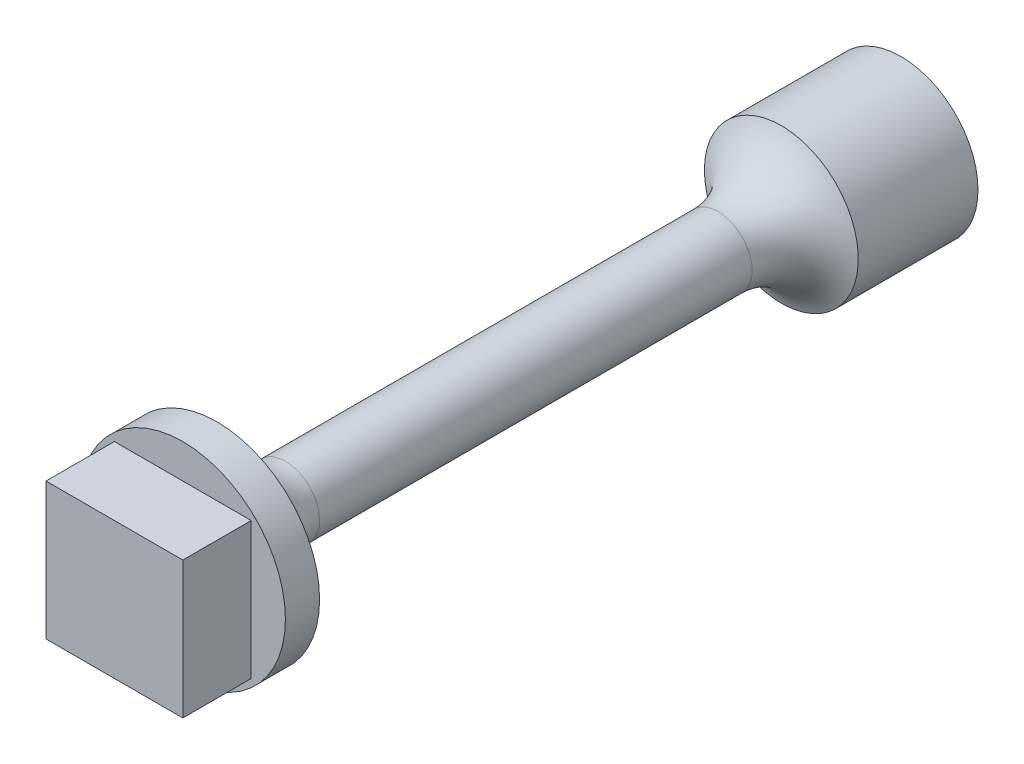
ISO-10303-21;
HEADER;
FILE_DESCRIPTION(('STEP AP214'),'2;1');
FILE_NAME('part.step','',(''),(''),'','','');
FILE_SCHEMA(('AUTOMOTIVE_DESIGN { 1 0 10303 214 1 1 1 1 }'));
ENDSEC;
DATA;
#1=APPLICATION_CONTEXT('core data for automotive mechanical design processes');
#2=APPLICATION_PROTOCOL_DEFINITION('international standard','automotive_design',2000,#1);
#3=PRODUCT_CONTEXT('',#1,'mechanical');
#4=PRODUCT('Part','Part','',(#3));
#5=PRODUCT_RELATED_PRODUCT_CATEGORY('part','',(#4));
#6=PRODUCT_DEFINITION_FORMATION('','',#4);
#7=PRODUCT_DEFINITION_CONTEXT('part definition',#1,'design');
#8=PRODUCT_DEFINITION('design','',#6,#7);
#9=PRODUCT_DEFINITION_SHAPE('','',#8);
#10=(LENGTH_UNIT() NAMED_UNIT(*) SI_UNIT(.MILLI.,.METRE.));
#11=(NAMED_UNIT(*) PLANE_ANGLE_UNIT() SI_UNIT($,.RADIAN.));
#12=(NAMED_UNIT(*) SI_UNIT($,.STERADIAN.) SOLID_ANGLE_UNIT());
#13=UNCERTAINTY_MEASURE_WITH_UNIT(LENGTH_MEASURE(1.E-05),#10,'distance_accuracy_value','');
#14=(GEOMETRIC_REPRESENTATION_CONTEXT(3) GLOBAL_UNCERTAINTY_ASSIGNED_CONTEXT((#13)) GLOBAL_UNIT_ASSIGNED_CONTEXT((#10,
#11,#12)) REPRESENTATION_CONTEXT('',''));
#15=CARTESIAN_POINT('',(0.,0.,0.));
#16=DIRECTION('',(0.,0.,1.));
#17=DIRECTION('',(1.,0.,0.));
#18=AXIS2_PLACEMENT_3D('',#15,#16,#17);
#19=CARTESIAN_POINT('',(0.,0.,21.));
#20=DIRECTION('',(0.,0.,-1.));
#21=DIRECTION('',(-1.,0.,0.));
#22=AXIS2_PLACEMENT_3D('',#19,#20,#21);
#23=CYLINDRICAL_SURFACE('',#22,3.);
#24=CARTESIAN_POINT('',(0.,0.,21.));
#25=DIRECTION('',(0.,0.,1.));
#26=DIRECTION('',(1.,0.,0.));
#27=AXIS2_PLACEMENT_3D('',#24,#25,#26);
#28=CIRCLE('',#27,3.);
#29=CARTESIAN_POINT('',(3.,0.,21.));
#30=VERTEX_POINT('',#29);
#31=EDGE_CURVE('E135',#30,#30,#28,.T.);
#32=ORIENTED_EDGE('',*,*,#31,.F.);
#33=EDGE_LOOP('',(#32));
#34=FACE_BOUND('',#33,.T.);
#35=CARTESIAN_POINT('',(0.,0.,20.));
#36=DIRECTION('',(0.,0.,1.));
#37=DIRECTION('',(1.,0.,0.));
#38=AXIS2_PLACEMENT_3D('',#35,#36,#37);
#39=CIRCLE('',#38,3.);
#40=CARTESIAN_POINT('',(3.,0.,20.));
#41=VERTEX_POINT('',#40);
#42=EDGE_CURVE('E130',#41,#41,#39,.T.);
#43=ORIENTED_EDGE('',*,*,#42,.T.);
#44=EDGE_LOOP('',(#43));
#45=FACE_BOUND('',#44,.T.);
#46=ADVANCED_FACE('F41',(#34,#45),#23,.T.);
#47=CARTESIAN_POINT('',(0.,0.,21.));
#48=DIRECTION('',(0.,0.,1.));
#49=DIRECTION('',(1.,0.,0.));
#50=AXIS2_PLACEMENT_3D('',#47,#48,#49);
#51=PLANE('',#50);
#52=DIRECTION('',(0.,-1.,0.));
#53=VECTOR('',#52,1.);
#54=CARTESIAN_POINT('',(-2.,-2.,21.));
#55=LINE('',#54,#53);
#56=CARTESIAN_POINT('',(-2.,2.,21.));
#57=VERTEX_POINT('',#56);
#58=CARTESIAN_POINT('',(-2.,-2.,21.));
#59=VERTEX_POINT('',#58);
#60=EDGE_CURVE('E57',#57,#59,#55,.T.);
#61=ORIENTED_EDGE('',*,*,#60,.F.);
#62=DIRECTION('',(-1.,0.,0.));
#63=VECTOR('',#62,1.);
#64=CARTESIAN_POINT('',(2.,2.,21.));
#65=LINE('',#64,#63);
#66=CARTESIAN_POINT('',(2.,2.,21.));
#67=VERTEX_POINT('',#66);
#68=EDGE_CURVE('E61',#67,#57,#65,.T.);
#69=ORIENTED_EDGE('',*,*,#68,.F.);
#70=DIRECTION('',(0.,1.,0.));
#71=VECTOR('',#70,1.);
#72=CARTESIAN_POINT('',(2.,-2.,21.));
#73=LINE('',#72,#71);
#74=CARTESIAN_POINT('',(2.,-2.,21.));
#75=VERTEX_POINT('',#74);
#76=EDGE_CURVE('E366',#75,#67,#73,.T.);
#77=ORIENTED_EDGE('',*,*,#76,.F.);
#78=DIRECTION('',(1.,0.,0.));
#79=VECTOR('',#78,1.);
#80=CARTESIAN_POINT('',(2.,-2.,21.));
#81=LINE('',#80,#79);
#82=EDGE_CURVE('E369',#59,#75,#81,.T.);
#83=ORIENTED_EDGE('',*,*,#82,.F.);
#84=EDGE_LOOP('',(#61,#69,#77,#83));
#85=FACE_BOUND('',#84,.T.);
#86=ORIENTED_EDGE('',*,*,#31,.T.);
#87=EDGE_LOOP('',(#86));
#88=FACE_BOUND('',#87,.T.);
#89=ADVANCED_FACE('F207',(#85,#88),#51,.T.);
#90=CARTESIAN_POINT('',(-2.,-2.,23.));
#91=DIRECTION('',(1.,0.,0.));
#92=DIRECTION('',(0.,0.,-1.));
#93=AXIS2_PLACEMENT_3D('',#90,#91,#92);
#94=PLANE('',#93);
#95=ORIENTED_EDGE('',*,*,#60,.T.);
#96=DIRECTION('',(0.,0.,-1.));
#97=VECTOR('',#96,1.);
#98=CARTESIAN_POINT('',(-2.,-2.,23.));
#99=LINE('',#98,#97);
#100=CARTESIAN_POINT('',(-2.,-2.,23.));
#101=VERTEX_POINT('',#100);
#102=EDGE_CURVE('E110',#101,#59,#99,.T.);
#103=ORIENTED_EDGE('',*,*,#102,.F.);
#104=DIRECTION('',(0.,-1.,0.));
#105=VECTOR('',#104,1.);
#106=CARTESIAN_POINT('',(-2.,-2.,23.));
#107=LINE('',#106,#105);
#108=CARTESIAN_POINT('',(-2.,2.,23.));
#109=VERTEX_POINT('',#108);
#110=EDGE_CURVE('E117',#109,#101,#107,.T.);
#111=ORIENTED_EDGE('',*,*,#110,.F.);
#112=DIRECTION('',(0.,0.,-1.));
#113=VECTOR('',#112,1.);
#114=CARTESIAN_POINT('',(-2.,2.,23.));
#115=LINE('',#114,#113);
#116=EDGE_CURVE('E372',#109,#57,#115,.T.);
#117=ORIENTED_EDGE('',*,*,#116,.T.);
#118=EDGE_LOOP('',(#95,#103,#111,#117));
#119=FACE_BOUND('',#118,.T.);
#120=ADVANCED_FACE('F128',(#119),#94,.F.);
#121=CARTESIAN_POINT('',(2.,-2.,23.));
#122=DIRECTION('',(0.,1.,0.));
#123=DIRECTION('',(-1.,0.,0.));
#124=AXIS2_PLACEMENT_3D('',#121,#122,#123);
#125=PLANE('',#124);
#126=ORIENTED_EDGE('',*,*,#82,.T.);
#127=DIRECTION('',(0.,0.,-1.));
#128=VECTOR('',#127,1.);
#129=CARTESIAN_POINT('',(2.,-2.,23.));
#130=LINE('',#129,#128);
#131=CARTESIAN_POINT('',(2.,-2.,23.));
#132=VERTEX_POINT('',#131);
#133=EDGE_CURVE('E112',#132,#75,#130,.T.);
#134=ORIENTED_EDGE('',*,*,#133,.F.);
#135=DIRECTION('',(1.,0.,0.));
#136=VECTOR('',#135,1.);
#137=CARTESIAN_POINT('',(2.,-2.,23.));
#138=LINE('',#137,#136);
#139=EDGE_CURVE('E105',#101,#132,#138,.T.);
#140=ORIENTED_EDGE('',*,*,#139,.F.);
#141=ORIENTED_EDGE('',*,*,#102,.T.);
#142=EDGE_LOOP('',(#126,#134,#140,#141));
#143=FACE_BOUND('',#142,.T.);
#144=ADVANCED_FACE('F108',(#143),#125,.F.);
#145=CARTESIAN_POINT('',(2.,-2.,23.));
#146=DIRECTION('',(-1.,0.,0.));
#147=DIRECTION('',(0.,-1.,0.));
#148=AXIS2_PLACEMENT_3D('',#145,#146,#147);
#149=PLANE('',#148);
#150=ORIENTED_EDGE('',*,*,#76,.T.);
#151=DIRECTION('',(0.,0.,-1.));
#152=VECTOR('',#151,1.);
#153=CARTESIAN_POINT('',(2.,2.,23.));
#154=LINE('',#153,#152);
#155=CARTESIAN_POINT('',(2.,2.,23.));
#156=VERTEX_POINT('',#155);
#157=EDGE_CURVE('E137',#156,#67,#154,.T.);
#158=ORIENTED_EDGE('',*,*,#157,.F.);
#159=DIRECTION('',(0.,1.,0.));
#160=VECTOR('',#159,1.);
#161=CARTESIAN_POINT('',(2.,-2.,23.));
#162=LINE('',#161,#160);
#163=EDGE_CURVE('E116',#132,#156,#162,.T.);
#164=ORIENTED_EDGE('',*,*,#163,.F.);
#165=ORIENTED_EDGE('',*,*,#133,.T.);
#166=EDGE_LOOP('',(#150,#158,#164,#165));
#167=FACE_BOUND('',#166,.T.);
#168=ADVANCED_FACE('F263',(#167),#149,.F.);
#169=CARTESIAN_POINT('',(2.,2.,23.));
#170=DIRECTION('',(0.,-1.,0.));
#171=DIRECTION('',(1.,0.,0.));
#172=AXIS2_PLACEMENT_3D('',#169,#170,#171);
#173=PLANE('',#172);
#174=ORIENTED_EDGE('',*,*,#68,.T.);
#175=ORIENTED_EDGE('',*,*,#116,.F.);
#176=DIRECTION('',(-1.,0.,0.));
#177=VECTOR('',#176,1.);
#178=CARTESIAN_POINT('',(2.,2.,23.));
#179=LINE('',#178,#177);
#180=EDGE_CURVE('E122',#156,#109,#179,.T.);
#181=ORIENTED_EDGE('',*,*,#180,.F.);
#182=ORIENTED_EDGE('',*,*,#157,.T.);
#183=EDGE_LOOP('',(#174,#175,#181,#182));
#184=FACE_BOUND('',#183,.T.);
#185=ADVANCED_FACE('F258',(#184),#173,.F.);
#186=CARTESIAN_POINT('',(0.,0.,23.));
#187=DIRECTION('',(0.,0.,1.));
#188=DIRECTION('',(1.,0.,0.));
#189=AXIS2_PLACEMENT_3D('',#186,#187,#188);
#190=PLANE('',#189);
#191=ORIENTED_EDGE('',*,*,#110,.T.);
#192=ORIENTED_EDGE('',*,*,#139,.T.);
#193=ORIENTED_EDGE('',*,*,#163,.T.);
#194=ORIENTED_EDGE('',*,*,#180,.T.);
#195=EDGE_LOOP('',(#191,#192,#193,#194));
#196=FACE_BOUND('',#195,.T.);
#197=ADVANCED_FACE('F120',(#196),#190,.T.);
#198=CARTESIAN_POINT('',(0.,0.,3.5));
#199=DIRECTION('',(0.,0.,1.));
#200=DIRECTION('',(1.,0.,0.));
#201=AXIS2_PLACEMENT_3D('',#198,#199,#200);
#202=CYLINDRICAL_SURFACE('',#201,1.);
#203=CARTESIAN_POINT('',(0.,0.,5.35404962177391));
#204=DIRECTION('',(0.,0.,-1.));
#205=DIRECTION('',(-1.,0.,0.));
#206=AXIS2_PLACEMENT_3D('',#203,#204,#205);
#207=CIRCLE('',#206,1.);
#208=CARTESIAN_POINT('',(-1.,0.,5.35404962177391));
#209=VERTEX_POINT('',#208);
#210=EDGE_CURVE('E12',#209,#209,#207,.F.);
#211=ORIENTED_EDGE('',*,*,#210,.T.);
#212=EDGE_LOOP('',(#211));
#213=FACE_BOUND('',#212,.T.);
#214=CARTESIAN_POINT('',(0.,0.,18.));
#215=DIRECTION('',(0.,0.,1.));
#216=DIRECTION('',(1.,0.,0.));
#217=AXIS2_PLACEMENT_3D('',#214,#215,#216);
#218=CIRCLE('',#217,1.);
#219=CARTESIAN_POINT('',(1.,0.,18.));
#220=VERTEX_POINT('',#219);
#221=EDGE_CURVE('E50',#220,#220,#218,.F.);
#222=ORIENTED_EDGE('',*,*,#221,.T.);
#223=EDGE_LOOP('',(#222));
#224=FACE_BOUND('',#223,.T.);
#225=ADVANCED_FACE('F199',(#213,#224),#202,.T.);
#226=CARTESIAN_POINT('',(0.,0.,2.5));
#227=DIRECTION('',(0.,0.,-1.));
#228=DIRECTION('',(-1.,0.,0.));
#229=AXIS2_PLACEMENT_3D('',#226,#227,#228);
#230=PLANE('',#229);
#231=DIRECTION('',(0.,-1.,0.));
#232=VECTOR('',#231,1.);
#233=CARTESIAN_POINT('',(1.2,0.,2.5));
#234=LINE('',#233,#232);
#235=CARTESIAN_POINT('',(1.2,1.2,2.5));
#236=VERTEX_POINT('',#235);
#237=CARTESIAN_POINT('',(1.2,-1.2,2.5));
#238=VERTEX_POINT('',#237);
#239=EDGE_CURVE('E145',#236,#238,#234,.T.);
#240=ORIENTED_EDGE('',*,*,#239,.T.);
#241=DIRECTION('',(-1.,0.,0.));
#242=VECTOR('',#241,1.);
#243=CARTESIAN_POINT('',(0.,-1.2,2.5));
#244=LINE('',#243,#242);
#245=CARTESIAN_POINT('',(-1.2,-1.2,2.5));
#246=VERTEX_POINT('',#245);
#247=EDGE_CURVE('E149',#238,#246,#244,.T.);
#248=ORIENTED_EDGE('',*,*,#247,.T.);
#249=DIRECTION('',(0.,1.,0.));
#250=VECTOR('',#249,1.);
#251=CARTESIAN_POINT('',(-1.2,0.,2.5));
#252=LINE('',#251,#250);
#253=CARTESIAN_POINT('',(-1.2,1.2,2.5));
#254=VERTEX_POINT('',#253);
#255=EDGE_CURVE('E154',#246,#254,#252,.T.);
#256=ORIENTED_EDGE('',*,*,#255,.T.);
#257=DIRECTION('',(1.,0.,0.));
#258=VECTOR('',#257,1.);
#259=CARTESIAN_POINT('',(0.,1.2,2.5));
#260=LINE('',#259,#258);
#261=EDGE_CURVE('E158',#254,#236,#260,.T.);
#262=ORIENTED_EDGE('',*,*,#261,.T.);
#263=EDGE_LOOP('',(#240,#248,#256,#262));
#264=FACE_BOUND('',#263,.T.);
#265=ADVANCED_FACE('F217',(#264),#230,.T.);
#266=CARTESIAN_POINT('',(-1.2,0.,2.5));
#267=DIRECTION('',(-1.,0.,0.));
#268=DIRECTION('',(0.,0.,1.));
#269=AXIS2_PLACEMENT_3D('',#266,#267,#268);
#270=PLANE('',#269);
#271=DIRECTION('',(0.,1.,0.));
#272=VECTOR('',#271,1.);
#273=CARTESIAN_POINT('',(-1.2,0.,0.));
#274=LINE('',#273,#272);
#275=CARTESIAN_POINT('',(-1.2,-1.2,0.));
#276=VERTEX_POINT('',#275);
#277=CARTESIAN_POINT('',(-1.2,1.2,0.));
#278=VERTEX_POINT('',#277);
#279=EDGE_CURVE('E169',#276,#278,#274,.T.);
#280=ORIENTED_EDGE('',*,*,#279,.T.);
#281=DIRECTION('',(0.,0.,-1.));
#282=VECTOR('',#281,1.);
#283=CARTESIAN_POINT('',(-1.2,1.2,2.5));
#284=LINE('',#283,#282);
#285=EDGE_CURVE('E180',#254,#278,#284,.T.);
#286=ORIENTED_EDGE('',*,*,#285,.F.);
#287=ORIENTED_EDGE('',*,*,#255,.F.);
#288=DIRECTION('',(0.,0.,-1.));
#289=VECTOR('',#288,1.);
#290=CARTESIAN_POINT('',(-1.2,-1.2,2.5));
#291=LINE('',#290,#289);
#292=EDGE_CURVE('E183',#246,#276,#291,.T.);
#293=ORIENTED_EDGE('',*,*,#292,.T.);
#294=EDGE_LOOP('',(#280,#286,#287,#293));
#295=FACE_BOUND('',#294,.T.);
#296=ADVANCED_FACE('F220',(#295),#270,.F.);
#297=CARTESIAN_POINT('',(0.,1.2,2.5));
#298=DIRECTION('',(0.,1.,0.));
#299=DIRECTION('',(-1.,0.,0.));
#300=AXIS2_PLACEMENT_3D('',#297,#298,#299);
#301=PLANE('',#300);
#302=DIRECTION('',(1.,0.,0.));
#303=VECTOR('',#302,1.);
#304=CARTESIAN_POINT('',(0.,1.2,0.));
#305=LINE('',#304,#303);
#306=CARTESIAN_POINT('',(1.2,1.2,0.));
#307=VERTEX_POINT('',#306);
#308=EDGE_CURVE('E150',#278,#307,#305,.T.);
#309=ORIENTED_EDGE('',*,*,#308,.T.);
#310=DIRECTION('',(0.,0.,-1.));
#311=VECTOR('',#310,1.);
#312=CARTESIAN_POINT('',(1.2,1.2,2.5));
#313=LINE('',#312,#311);
#314=EDGE_CURVE('E176',#236,#307,#313,.T.);
#315=ORIENTED_EDGE('',*,*,#314,.F.);
#316=ORIENTED_EDGE('',*,*,#261,.F.);
#317=ORIENTED_EDGE('',*,*,#285,.T.);
#318=EDGE_LOOP('',(#309,#315,#316,#317));
#319=FACE_BOUND('',#318,.T.);
#320=ADVANCED_FACE('F222',(#319),#301,.F.);
#321=CARTESIAN_POINT('',(1.2,0.,2.5));
#322=DIRECTION('',(1.,0.,0.));
#323=DIRECTION('',(0.,0.,-1.));
#324=AXIS2_PLACEMENT_3D('',#321,#322,#323);
#325=PLANE('',#324);
#326=DIRECTION('',(0.,-1.,0.));
#327=VECTOR('',#326,1.);
#328=CARTESIAN_POINT('',(1.2,0.,0.));
#329=LINE('',#328,#327);
#330=CARTESIAN_POINT('',(1.2,-1.2,0.));
#331=VERTEX_POINT('',#330);
#332=EDGE_CURVE('E143',#307,#331,#329,.T.);
#333=ORIENTED_EDGE('',*,*,#332,.T.);
#334=DIRECTION('',(0.,0.,-1.));
#335=VECTOR('',#334,1.);
#336=CARTESIAN_POINT('',(1.2,-1.2,2.5));
#337=LINE('',#336,#335);
#338=EDGE_CURVE('E162',#238,#331,#337,.T.);
#339=ORIENTED_EDGE('',*,*,#338,.F.);
#340=ORIENTED_EDGE('',*,*,#239,.F.);
#341=ORIENTED_EDGE('',*,*,#314,.T.);
#342=EDGE_LOOP('',(#333,#339,#340,#341));
#343=FACE_BOUND('',#342,.T.);
#344=ADVANCED_FACE('F225',(#343),#325,.F.);
#345=CARTESIAN_POINT('',(0.,-1.2,2.5));
#346=DIRECTION('',(0.,-1.,0.));
#347=DIRECTION('',(1.,0.,0.));
#348=AXIS2_PLACEMENT_3D('',#345,#346,#347);
#349=PLANE('',#348);
#350=DIRECTION('',(-1.,0.,0.));
#351=VECTOR('',#350,1.);
#352=CARTESIAN_POINT('',(0.,-1.2,0.));
#353=LINE('',#352,#351);
#354=EDGE_CURVE('E165',#331,#276,#353,.T.);
#355=ORIENTED_EDGE('',*,*,#354,.T.);
#356=ORIENTED_EDGE('',*,*,#292,.F.);
#357=ORIENTED_EDGE('',*,*,#247,.F.);
#358=ORIENTED_EDGE('',*,*,#338,.T.);
#359=EDGE_LOOP('',(#355,#356,#357,#358));
#360=FACE_BOUND('',#359,.T.);
#361=ADVANCED_FACE('F230',(#360),#349,.F.);
#362=CARTESIAN_POINT('',(0.,0.,0.));
#363=DIRECTION('',(0.,0.,1.));
#364=DIRECTION('',(1.,0.,0.));
#365=AXIS2_PLACEMENT_3D('',#362,#363,#364);
#366=PLANE('',#365);
#367=ORIENTED_EDGE('',*,*,#354,.F.);
#368=ORIENTED_EDGE('',*,*,#332,.F.);
#369=ORIENTED_EDGE('',*,*,#308,.F.);
#370=ORIENTED_EDGE('',*,*,#279,.F.);
#371=EDGE_LOOP('',(#367,#368,#369,#370));
#372=FACE_BOUND('',#371,.T.);
#373=CARTESIAN_POINT('',(0.,0.,0.));
#374=DIRECTION('',(0.,0.,1.));
#375=DIRECTION('',(1.,0.,0.));
#376=AXIS2_PLACEMENT_3D('',#373,#374,#375);
#377=CIRCLE('',#376,2.25);
#378=CARTESIAN_POINT('',(2.25,0.,0.));
#379=VERTEX_POINT('',#378);
#380=EDGE_CURVE('E179',#379,#379,#377,.T.);
#381=ORIENTED_EDGE('',*,*,#380,.F.);
#382=EDGE_LOOP('',(#381));
#383=FACE_BOUND('',#382,.T.);
#384=ADVANCED_FACE('F233',(#372,#383),#366,.F.);
#385=CARTESIAN_POINT('',(0.,0.,20.));
#386=DIRECTION('',(0.,0.,-1.));
#387=DIRECTION('',(-1.,0.,0.));
#388=AXIS2_PLACEMENT_3D('',#385,#386,#387);
#389=CYLINDRICAL_SURFACE('',#388,2.25);
#390=CARTESIAN_POINT('',(0.,0.,3.5));
#391=DIRECTION('',(0.,0.,-1.));
#392=DIRECTION('',(-1.,0.,0.));
#393=AXIS2_PLACEMENT_3D('',#390,#391,#392);
#394=CIRCLE('',#393,2.25);
#395=CARTESIAN_POINT('',(-2.25,0.,3.5));
#396=VERTEX_POINT('',#395);
#397=EDGE_CURVE('E192',#396,#396,#394,.T.);
#398=ORIENTED_EDGE('',*,*,#397,.T.);
#399=EDGE_LOOP('',(#398));
#400=FACE_BOUND('',#399,.T.);
#401=ORIENTED_EDGE('',*,*,#380,.T.);
#402=EDGE_LOOP('',(#401));
#403=FACE_BOUND('',#402,.T.);
#404=ADVANCED_FACE('F240',(#400,#403),#389,.T.);
#405=CARTESIAN_POINT('',(0.,0.,5.35404962177391));
#406=DIRECTION('',(0.,0.,-1.));
#407=DIRECTION('',(-1.,0.,0.));
#408=AXIS2_PLACEMENT_3D('',#405,#406,#407);
#409=TOROIDAL_SURFACE('',#408,3.,2.);
#410=ORIENTED_EDGE('',*,*,#397,.F.);
#411=EDGE_LOOP('',(#410));
#412=FACE_BOUND('',#411,.T.);
#413=ORIENTED_EDGE('',*,*,#210,.F.);
#414=EDGE_LOOP('',(#413));
#415=FACE_BOUND('',#414,.T.);
#416=ADVANCED_FACE('F203',(#412,#415),#409,.F.);
#417=CARTESIAN_POINT('',(0.,0.,18.));
#418=DIRECTION('',(0.,0.,1.));
#419=DIRECTION('',(1.,0.,0.));
#420=AXIS2_PLACEMENT_3D('',#417,#418,#419);
#421=TOROIDAL_SURFACE('',#420,3.,2.);
#422=ORIENTED_EDGE('',*,*,#221,.F.);
#423=EDGE_LOOP('',(#422));
#424=FACE_BOUND('',#423,.T.);
#425=ORIENTED_EDGE('',*,*,#42,.F.);
#426=EDGE_LOOP('',(#425));
#427=FACE_BOUND('',#426,.T.);
#428=ADVANCED_FACE('F43',(#424,#427),#421,.F.);
#429=CLOSED_SHELL('',(#46,#89,#120,#144,#168,#185,#197,#225,#265,#296,#320,#344,#361,#384,#404,
#416,#428));
#430=MANIFOLD_SOLID_BREP('B2',#429);
#431=ADVANCED_BREP_SHAPE_REPRESENTATION('',(#18,#430),#14);
#432=SHAPE_DEFINITION_REPRESENTATION(#9,#431);
ENDSEC;
END-ISO-10303-21;
